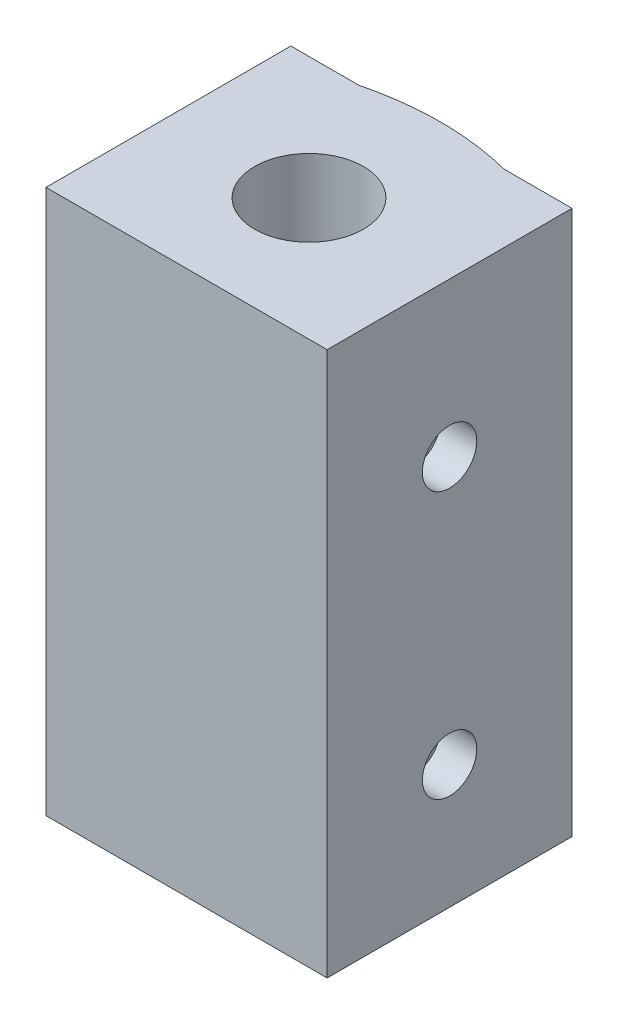
ISO-10303-21;
HEADER;
FILE_DESCRIPTION(('STEP AP214'),'2;1');
FILE_NAME('part.step','',(''),(''),'','','');
FILE_SCHEMA(('AUTOMOTIVE_DESIGN { 1 0 10303 214 1 1 1 1 }'));
ENDSEC;
DATA;
#1=APPLICATION_CONTEXT('core data for automotive mechanical design processes');
#2=APPLICATION_PROTOCOL_DEFINITION('international standard','automotive_design',2000,#1);
#3=PRODUCT_CONTEXT('',#1,'mechanical');
#4=PRODUCT('Part','Part','',(#3));
#5=PRODUCT_RELATED_PRODUCT_CATEGORY('part','',(#4));
#6=PRODUCT_DEFINITION_FORMATION('','',#4);
#7=PRODUCT_DEFINITION_CONTEXT('part definition',#1,'design');
#8=PRODUCT_DEFINITION('design','',#6,#7);
#9=PRODUCT_DEFINITION_SHAPE('','',#8);
#10=(LENGTH_UNIT() NAMED_UNIT(*) SI_UNIT(.MILLI.,.METRE.));
#11=(NAMED_UNIT(*) PLANE_ANGLE_UNIT() SI_UNIT($,.RADIAN.));
#12=(NAMED_UNIT(*) SI_UNIT($,.STERADIAN.) SOLID_ANGLE_UNIT());
#13=UNCERTAINTY_MEASURE_WITH_UNIT(LENGTH_MEASURE(1.E-05),#10,'distance_accuracy_value','');
#14=(GEOMETRIC_REPRESENTATION_CONTEXT(3) GLOBAL_UNCERTAINTY_ASSIGNED_CONTEXT((#13)) GLOBAL_UNIT_ASSIGNED_CONTEXT((#10,
#11,#12)) REPRESENTATION_CONTEXT('',''));
#15=CARTESIAN_POINT('',(0.,0.,0.));
#16=DIRECTION('',(0.,0.,1.));
#17=DIRECTION('',(1.,0.,0.));
#18=AXIS2_PLACEMENT_3D('',#15,#16,#17);
#19=CARTESIAN_POINT('',(0.,30.,0.));
#20=DIRECTION('',(1.,0.,0.));
#21=DIRECTION('',(0.,0.,-1.));
#22=AXIS2_PLACEMENT_3D('',#19,#20,#21);
#23=PLANE('',#22);
#24=DIRECTION('',(0.,0.,1.));
#25=VECTOR('',#24,1.);
#26=CARTESIAN_POINT('',(0.,0.,0.));
#27=LINE('',#26,#25);
#28=CARTESIAN_POINT('',(0.,0.,-13.5));
#29=VERTEX_POINT('',#28);
#30=CARTESIAN_POINT('',(0.,0.,0.));
#31=VERTEX_POINT('',#30);
#32=EDGE_CURVE('E148',#29,#31,#27,.T.);
#33=ORIENTED_EDGE('',*,*,#32,.T.);
#34=DIRECTION('',(0.,-1.,0.));
#35=VECTOR('',#34,1.);
#36=CARTESIAN_POINT('',(0.,30.,0.));
#37=LINE('',#36,#35);
#38=CARTESIAN_POINT('',(0.,30.,0.));
#39=VERTEX_POINT('',#38);
#40=EDGE_CURVE('E14',#39,#31,#37,.T.);
#41=ORIENTED_EDGE('',*,*,#40,.F.);
#42=DIRECTION('',(0.,0.,1.));
#43=VECTOR('',#42,1.);
#44=CARTESIAN_POINT('',(0.,30.,0.));
#45=LINE('',#44,#43);
#46=CARTESIAN_POINT('',(0.,30.,-13.5));
#47=VERTEX_POINT('',#46);
#48=EDGE_CURVE('E165',#47,#39,#45,.T.);
#49=ORIENTED_EDGE('',*,*,#48,.F.);
#50=DIRECTION('',(0.,-1.,0.));
#51=VECTOR('',#50,1.);
#52=CARTESIAN_POINT('',(0.,30.,-13.5));
#53=LINE('',#52,#51);
#54=EDGE_CURVE('E144',#47,#29,#53,.T.);
#55=ORIENTED_EDGE('',*,*,#54,.T.);
#56=EDGE_LOOP('',(#33,#41,#49,#55));
#57=FACE_BOUND('',#56,.T.);
#58=ADVANCED_FACE('F57',(#57),#23,.F.);
#59=CARTESIAN_POINT('',(0.,30.,0.));
#60=DIRECTION('',(0.,0.,-1.));
#61=DIRECTION('',(-1.,0.,0.));
#62=AXIS2_PLACEMENT_3D('',#59,#60,#61);
#63=PLANE('',#62);
#64=DIRECTION('',(1.,0.,0.));
#65=VECTOR('',#64,1.);
#66=CARTESIAN_POINT('',(0.,0.,0.));
#67=LINE('',#66,#65);
#68=CARTESIAN_POINT('',(15.5,0.,0.));
#69=VERTEX_POINT('',#68);
#70=EDGE_CURVE('E152',#31,#69,#67,.T.);
#71=ORIENTED_EDGE('',*,*,#70,.T.);
#72=DIRECTION('',(0.,-1.,0.));
#73=VECTOR('',#72,1.);
#74=CARTESIAN_POINT('',(15.5,30.,0.));
#75=LINE('',#74,#73);
#76=CARTESIAN_POINT('',(15.5,30.,0.));
#77=VERTEX_POINT('',#76);
#78=EDGE_CURVE('E66',#77,#69,#75,.T.);
#79=ORIENTED_EDGE('',*,*,#78,.F.);
#80=DIRECTION('',(1.,0.,0.));
#81=VECTOR('',#80,1.);
#82=CARTESIAN_POINT('',(0.,30.,0.));
#83=LINE('',#82,#81);
#84=EDGE_CURVE('E111',#39,#77,#83,.T.);
#85=ORIENTED_EDGE('',*,*,#84,.F.);
#86=ORIENTED_EDGE('',*,*,#40,.T.);
#87=EDGE_LOOP('',(#71,#79,#85,#86));
#88=FACE_BOUND('',#87,.T.);
#89=ADVANCED_FACE('F196',(#88),#63,.F.);
#90=CARTESIAN_POINT('',(15.5,30.,0.));
#91=DIRECTION('',(-1.,0.,0.));
#92=DIRECTION('',(0.,0.,1.));
#93=AXIS2_PLACEMENT_3D('',#90,#91,#92);
#94=PLANE('',#93);
#95=CARTESIAN_POINT('',(15.5,21.515,-6.75));
#96=DIRECTION('',(1.,0.,0.));
#97=DIRECTION('',(0.,0.,-1.));
#98=AXIS2_PLACEMENT_3D('',#95,#96,#97);
#99=CIRCLE('',#98,1.5);
#100=CARTESIAN_POINT('',(15.5,21.515,-8.25));
#101=VERTEX_POINT('',#100);
#102=EDGE_CURVE('E356',#101,#101,#99,.T.);
#103=ORIENTED_EDGE('',*,*,#102,.F.);
#104=EDGE_LOOP('',(#103));
#105=FACE_BOUND('',#104,.T.);
#106=CARTESIAN_POINT('',(15.5,6.815,-6.75));
#107=DIRECTION('',(1.,0.,0.));
#108=DIRECTION('',(0.,0.,-1.));
#109=AXIS2_PLACEMENT_3D('',#106,#107,#108);
#110=CIRCLE('',#109,1.5);
#111=CARTESIAN_POINT('',(15.5,6.815,-8.25));
#112=VERTEX_POINT('',#111);
#113=EDGE_CURVE('E366',#112,#112,#110,.T.);
#114=ORIENTED_EDGE('',*,*,#113,.F.);
#115=EDGE_LOOP('',(#114));
#116=FACE_BOUND('',#115,.T.);
#117=DIRECTION('',(0.,0.,-1.));
#118=VECTOR('',#117,1.);
#119=CARTESIAN_POINT('',(15.5,0.,0.));
#120=LINE('',#119,#118);
#121=CARTESIAN_POINT('',(15.5,0.,-13.5));
#122=VERTEX_POINT('',#121);
#123=EDGE_CURVE('E156',#69,#122,#120,.T.);
#124=ORIENTED_EDGE('',*,*,#123,.T.);
#125=DIRECTION('',(0.,-1.,0.));
#126=VECTOR('',#125,1.);
#127=CARTESIAN_POINT('',(15.5,30.,-13.5));
#128=LINE('',#127,#126);
#129=CARTESIAN_POINT('',(15.5,30.,-13.5));
#130=VERTEX_POINT('',#129);
#131=EDGE_CURVE('E135',#130,#122,#128,.T.);
#132=ORIENTED_EDGE('',*,*,#131,.F.);
#133=DIRECTION('',(0.,0.,-1.));
#134=VECTOR('',#133,1.);
#135=CARTESIAN_POINT('',(15.5,30.,0.));
#136=LINE('',#135,#134);
#137=EDGE_CURVE('E124',#77,#130,#136,.T.);
#138=ORIENTED_EDGE('',*,*,#137,.F.);
#139=ORIENTED_EDGE('',*,*,#78,.T.);
#140=EDGE_LOOP('',(#124,#132,#138,#139));
#141=FACE_BOUND('',#140,.T.);
#142=ADVANCED_FACE('F177',(#105,#116,#141),#94,.F.);
#143=CARTESIAN_POINT('',(11.75,30.,-13.5));
#144=DIRECTION('',(0.,0.,1.));
#145=DIRECTION('',(1.,0.,0.));
#146=AXIS2_PLACEMENT_3D('',#143,#144,#145);
#147=PLANE('',#146);
#148=DIRECTION('',(-1.,0.,0.));
#149=VECTOR('',#148,1.);
#150=CARTESIAN_POINT('',(11.75,0.,-13.5));
#151=LINE('',#150,#149);
#152=CARTESIAN_POINT('',(11.75,0.,-13.5));
#153=VERTEX_POINT('',#152);
#154=EDGE_CURVE('E133',#122,#153,#151,.T.);
#155=ORIENTED_EDGE('',*,*,#154,.T.);
#156=DIRECTION('',(0.,-1.,0.));
#157=VECTOR('',#156,1.);
#158=CARTESIAN_POINT('',(11.75,30.,-13.5));
#159=LINE('',#158,#157);
#160=CARTESIAN_POINT('',(11.75,30.,-13.5));
#161=VERTEX_POINT('',#160);
#162=EDGE_CURVE('E130',#161,#153,#159,.T.);
#163=ORIENTED_EDGE('',*,*,#162,.F.);
#164=DIRECTION('',(-1.,0.,0.));
#165=VECTOR('',#164,1.);
#166=CARTESIAN_POINT('',(11.75,30.,-13.5));
#167=LINE('',#166,#165);
#168=EDGE_CURVE('E118',#130,#161,#167,.T.);
#169=ORIENTED_EDGE('',*,*,#168,.F.);
#170=ORIENTED_EDGE('',*,*,#131,.T.);
#171=EDGE_LOOP('',(#155,#163,#169,#170));
#172=FACE_BOUND('',#171,.T.);
#173=ADVANCED_FACE('F131',(#172),#147,.F.);
#174=CARTESIAN_POINT('',(7.75,30.,2.24999999999999));
#175=DIRECTION('',(0.,-1.,0.));
#176=DIRECTION('',(0.,0.,-1.));
#177=AXIS2_PLACEMENT_3D('',#174,#175,#176);
#178=CYLINDRICAL_SURFACE('',#177,16.25);
#179=CARTESIAN_POINT('',(7.75,0.,2.24999999999999));
#180=DIRECTION('',(0.,1.,0.));
#181=DIRECTION('',(0.,0.,-1.));
#182=AXIS2_PLACEMENT_3D('',#179,#180,#181);
#183=CIRCLE('',#182,16.25);
#184=CARTESIAN_POINT('',(3.74999999999999,0.,-13.5));
#185=VERTEX_POINT('',#184);
#186=EDGE_CURVE('E97',#153,#185,#183,.T.);
#187=ORIENTED_EDGE('',*,*,#186,.T.);
#188=DIRECTION('',(0.,-1.,0.));
#189=VECTOR('',#188,1.);
#190=CARTESIAN_POINT('',(3.74999999999999,30.,-13.5));
#191=LINE('',#190,#189);
#192=CARTESIAN_POINT('',(3.74999999999999,30.,-13.5));
#193=VERTEX_POINT('',#192);
#194=EDGE_CURVE('E136',#193,#185,#191,.T.);
#195=ORIENTED_EDGE('',*,*,#194,.F.);
#196=CARTESIAN_POINT('',(7.75,30.,2.24999999999999));
#197=DIRECTION('',(0.,1.,0.));
#198=DIRECTION('',(0.,0.,-1.));
#199=AXIS2_PLACEMENT_3D('',#196,#197,#198);
#200=CIRCLE('',#199,16.25);
#201=EDGE_CURVE('E122',#161,#193,#200,.T.);
#202=ORIENTED_EDGE('',*,*,#201,.F.);
#203=ORIENTED_EDGE('',*,*,#162,.T.);
#204=EDGE_LOOP('',(#187,#195,#202,#203));
#205=FACE_BOUND('',#204,.T.);
#206=ADVANCED_FACE('F138',(#205),#178,.T.);
#207=CARTESIAN_POINT('',(0.,30.,-13.5));
#208=DIRECTION('',(0.,0.,1.));
#209=DIRECTION('',(1.,0.,0.));
#210=AXIS2_PLACEMENT_3D('',#207,#208,#209);
#211=PLANE('',#210);
#212=DIRECTION('',(-1.,0.,0.));
#213=VECTOR('',#212,1.);
#214=CARTESIAN_POINT('',(0.,0.,-13.5));
#215=LINE('',#214,#213);
#216=EDGE_CURVE('E103',#185,#29,#215,.T.);
#217=ORIENTED_EDGE('',*,*,#216,.T.);
#218=ORIENTED_EDGE('',*,*,#54,.F.);
#219=DIRECTION('',(-1.,0.,0.));
#220=VECTOR('',#219,1.);
#221=CARTESIAN_POINT('',(0.,30.,-13.5));
#222=LINE('',#221,#220);
#223=EDGE_CURVE('E74',#193,#47,#222,.T.);
#224=ORIENTED_EDGE('',*,*,#223,.F.);
#225=ORIENTED_EDGE('',*,*,#194,.T.);
#226=EDGE_LOOP('',(#217,#218,#224,#225));
#227=FACE_BOUND('',#226,.T.);
#228=ADVANCED_FACE('F184',(#227),#211,.F.);
#229=CARTESIAN_POINT('',(7.75,30.,2.24999999999999));
#230=DIRECTION('',(0.,-1.,0.));
#231=DIRECTION('',(0.,0.,-1.));
#232=AXIS2_PLACEMENT_3D('',#229,#230,#231);
#233=PLANE('',#232);
#234=CARTESIAN_POINT('',(7.75,30.,-6.75));
#235=DIRECTION('',(0.,1.,0.));
#236=DIRECTION('',(0.,0.,1.));
#237=AXIS2_PLACEMENT_3D('',#234,#235,#236);
#238=CIRCLE('',#237,3.);
#239=CARTESIAN_POINT('',(7.75,30.,-3.75));
#240=VERTEX_POINT('',#239);
#241=EDGE_CURVE('E378',#240,#240,#238,.T.);
#242=ORIENTED_EDGE('',*,*,#241,.F.);
#243=EDGE_LOOP('',(#242));
#244=FACE_BOUND('',#243,.T.);
#245=ORIENTED_EDGE('',*,*,#48,.T.);
#246=ORIENTED_EDGE('',*,*,#84,.T.);
#247=ORIENTED_EDGE('',*,*,#137,.T.);
#248=ORIENTED_EDGE('',*,*,#168,.T.);
#249=ORIENTED_EDGE('',*,*,#201,.T.);
#250=ORIENTED_EDGE('',*,*,#223,.T.);
#251=EDGE_LOOP('',(#245,#246,#247,#248,#249,#250));
#252=FACE_BOUND('',#251,.T.);
#253=ADVANCED_FACE('F120',(#244,#252),#233,.F.);
#254=CARTESIAN_POINT('',(7.75,0.,2.24999999999999));
#255=DIRECTION('',(0.,-1.,0.));
#256=DIRECTION('',(0.,0.,-1.));
#257=AXIS2_PLACEMENT_3D('',#254,#255,#256);
#258=PLANE('',#257);
#259=CARTESIAN_POINT('',(7.75,0.,-6.75));
#260=DIRECTION('',(0.,1.,0.));
#261=DIRECTION('',(0.,0.,1.));
#262=AXIS2_PLACEMENT_3D('',#259,#260,#261);
#263=CIRCLE('',#262,1.75);
#264=CARTESIAN_POINT('',(7.75,0.,-5.));
#265=VERTEX_POINT('',#264);
#266=EDGE_CURVE('E363',#265,#265,#263,.T.);
#267=ORIENTED_EDGE('',*,*,#266,.T.);
#268=EDGE_LOOP('',(#267));
#269=FACE_BOUND('',#268,.T.);
#270=ORIENTED_EDGE('',*,*,#32,.F.);
#271=ORIENTED_EDGE('',*,*,#216,.F.);
#272=ORIENTED_EDGE('',*,*,#186,.F.);
#273=ORIENTED_EDGE('',*,*,#154,.F.);
#274=ORIENTED_EDGE('',*,*,#123,.F.);
#275=ORIENTED_EDGE('',*,*,#70,.F.);
#276=EDGE_LOOP('',(#270,#271,#272,#273,#274,#275));
#277=FACE_BOUND('',#276,.T.);
#278=ADVANCED_FACE('F180',(#269,#277),#258,.T.);
#279=CARTESIAN_POINT('',(7.75,12.,2.24999999999999));
#280=DIRECTION('',(0.,-1.,0.));
#281=DIRECTION('',(0.,0.,-1.));
#282=AXIS2_PLACEMENT_3D('',#279,#280,#281);
#283=PLANE('',#282);
#284=CARTESIAN_POINT('',(7.75,12.,-6.75));
#285=DIRECTION('',(0.,1.,0.));
#286=DIRECTION('',(0.,0.,1.));
#287=AXIS2_PLACEMENT_3D('',#284,#285,#286);
#288=CIRCLE('',#287,1.75);
#289=CARTESIAN_POINT('',(7.75,12.,-5.));
#290=VERTEX_POINT('',#289);
#291=EDGE_CURVE('E355',#290,#290,#288,.T.);
#292=ORIENTED_EDGE('',*,*,#291,.F.);
#293=EDGE_LOOP('',(#292));
#294=FACE_BOUND('',#293,.T.);
#295=CARTESIAN_POINT('',(7.75,12.,-6.75));
#296=DIRECTION('',(0.,-1.,0.));
#297=DIRECTION('',(0.,0.,-1.));
#298=AXIS2_PLACEMENT_3D('',#295,#296,#297);
#299=CIRCLE('',#298,3.);
#300=CARTESIAN_POINT('',(7.75,12.,-9.75));
#301=VERTEX_POINT('',#300);
#302=EDGE_CURVE('E153',#301,#301,#299,.F.);
#303=ORIENTED_EDGE('',*,*,#302,.T.);
#304=EDGE_LOOP('',(#303));
#305=FACE_BOUND('',#304,.T.);
#306=ADVANCED_FACE('F241',(#294,#305),#283,.F.);
#307=CARTESIAN_POINT('',(7.75,-14.4852813742386,-6.75));
#308=DIRECTION('',(0.,1.,0.));
#309=DIRECTION('',(0.,0.,1.));
#310=AXIS2_PLACEMENT_3D('',#307,#308,#309);
#311=CYLINDRICAL_SURFACE('',#310,3.);
#312=ORIENTED_EDGE('',*,*,#241,.T.);
#313=EDGE_LOOP('',(#312));
#314=FACE_BOUND('',#313,.T.);
#315=ORIENTED_EDGE('',*,*,#302,.F.);
#316=EDGE_LOOP('',(#315));
#317=FACE_BOUND('',#316,.T.);
#318=ADVANCED_FACE('F235',(#314,#317),#311,.F.);
#319=CARTESIAN_POINT('',(7.75,0.,-6.75));
#320=DIRECTION('',(0.,1.,0.));
#321=DIRECTION('',(0.,0.,1.));
#322=AXIS2_PLACEMENT_3D('',#319,#320,#321);
#323=CYLINDRICAL_SURFACE('',#322,1.75);
#324=ORIENTED_EDGE('',*,*,#266,.F.);
#325=EDGE_LOOP('',(#324));
#326=FACE_BOUND('',#325,.T.);
#327=ORIENTED_EDGE('',*,*,#291,.T.);
#328=EDGE_LOOP('',(#327));
#329=FACE_BOUND('',#328,.T.);
#330=ADVANCED_FACE('F240',(#326,#329),#323,.F.);
#331=CARTESIAN_POINT('',(13.5,6.815,-6.75));
#332=DIRECTION('',(1.,0.,0.));
#333=DIRECTION('',(0.,0.,-1.));
#334=AXIS2_PLACEMENT_3D('',#331,#332,#333);
#335=CYLINDRICAL_SURFACE('',#334,1.5);
#336=CARTESIAN_POINT('',(13.5,6.815,-6.75));
#337=DIRECTION('',(1.,0.,0.));
#338=DIRECTION('',(0.,0.,-1.));
#339=AXIS2_PLACEMENT_3D('',#336,#337,#338);
#340=CIRCLE('',#339,1.5);
#341=CARTESIAN_POINT('',(13.5,6.815,-8.25));
#342=VERTEX_POINT('',#341);
#343=EDGE_CURVE('E372',#342,#342,#340,.T.);
#344=ORIENTED_EDGE('',*,*,#343,.F.);
#345=EDGE_LOOP('',(#344));
#346=FACE_BOUND('',#345,.T.);
#347=ORIENTED_EDGE('',*,*,#113,.T.);
#348=EDGE_LOOP('',(#347));
#349=FACE_BOUND('',#348,.T.);
#350=ADVANCED_FACE('F268',(#346,#349),#335,.F.);
#351=CARTESIAN_POINT('',(13.5,6.815,-6.75));
#352=DIRECTION('',(1.,0.,0.));
#353=DIRECTION('',(0.,0.,-1.));
#354=AXIS2_PLACEMENT_3D('',#351,#352,#353);
#355=PLANE('',#354);
#356=ORIENTED_EDGE('',*,*,#343,.T.);
#357=EDGE_LOOP('',(#356));
#358=FACE_BOUND('',#357,.T.);
#359=ADVANCED_FACE('F286',(#358),#355,.T.);
#360=CARTESIAN_POINT('',(13.5,21.515,-6.75));
#361=DIRECTION('',(1.,0.,0.));
#362=DIRECTION('',(0.,0.,-1.));
#363=AXIS2_PLACEMENT_3D('',#360,#361,#362);
#364=CYLINDRICAL_SURFACE('',#363,1.5);
#365=CARTESIAN_POINT('',(13.5,21.515,-6.75));
#366=DIRECTION('',(1.,0.,0.));
#367=DIRECTION('',(0.,0.,-1.));
#368=AXIS2_PLACEMENT_3D('',#365,#366,#367);
#369=CIRCLE('',#368,1.5);
#370=CARTESIAN_POINT('',(13.5,21.515,-8.25));
#371=VERTEX_POINT('',#370);
#372=EDGE_CURVE('E353',#371,#371,#369,.T.);
#373=ORIENTED_EDGE('',*,*,#372,.F.);
#374=EDGE_LOOP('',(#373));
#375=FACE_BOUND('',#374,.T.);
#376=ORIENTED_EDGE('',*,*,#102,.T.);
#377=EDGE_LOOP('',(#376));
#378=FACE_BOUND('',#377,.T.);
#379=ADVANCED_FACE('F297',(#375,#378),#364,.F.);
#380=CARTESIAN_POINT('',(13.5,21.515,-6.75));
#381=DIRECTION('',(1.,0.,0.));
#382=DIRECTION('',(0.,0.,-1.));
#383=AXIS2_PLACEMENT_3D('',#380,#381,#382);
#384=PLANE('',#383);
#385=ORIENTED_EDGE('',*,*,#372,.T.);
#386=EDGE_LOOP('',(#385));
#387=FACE_BOUND('',#386,.T.);
#388=ADVANCED_FACE('F308',(#387),#384,.T.);
#389=CLOSED_SHELL('',(#58,#89,#142,#173,#206,#228,#253,#278,#306,#318,#330,#350,#359,#379,#388));
#390=MANIFOLD_SOLID_BREP('B2',#389);
#391=ADVANCED_BREP_SHAPE_REPRESENTATION('',(#18,#390),#14);
#392=SHAPE_DEFINITION_REPRESENTATION(#9,#391);
ENDSEC;
END-ISO-10303-21;
